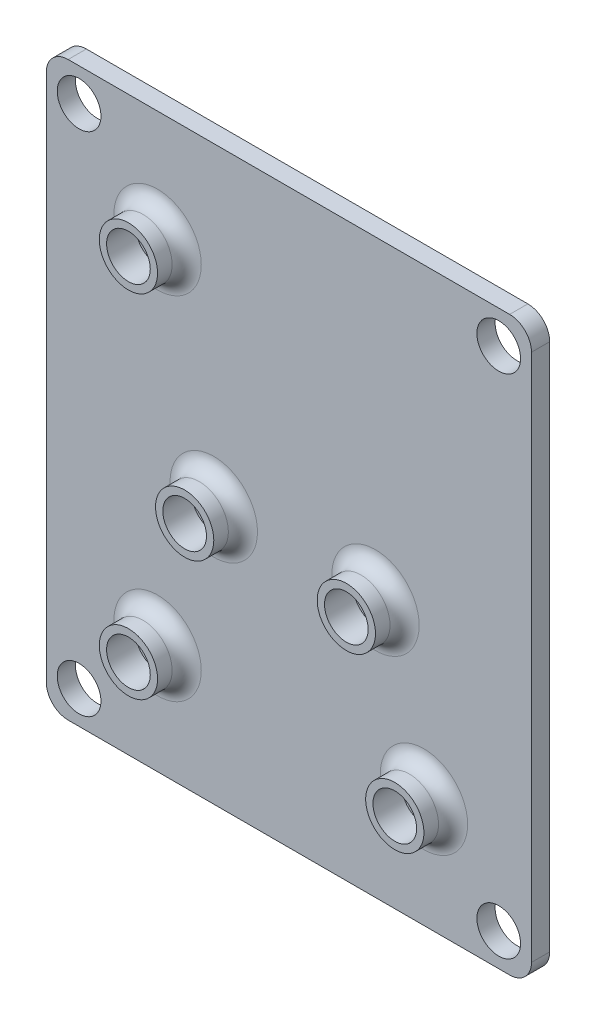
ISO-10303-21;
HEADER;
FILE_DESCRIPTION(('STEP AP214'),'2;1');
FILE_NAME('part.step','',(''),(''),'','','');
FILE_SCHEMA(('AUTOMOTIVE_DESIGN { 1 0 10303 214 1 1 1 1 }'));
ENDSEC;
DATA;
#1=APPLICATION_CONTEXT('core data for automotive mechanical design processes');
#2=APPLICATION_PROTOCOL_DEFINITION('international standard','automotive_design',2000,#1);
#3=PRODUCT_CONTEXT('',#1,'mechanical');
#4=PRODUCT('Part','Part','',(#3));
#5=PRODUCT_RELATED_PRODUCT_CATEGORY('part','',(#4));
#6=PRODUCT_DEFINITION_FORMATION('','',#4);
#7=PRODUCT_DEFINITION_CONTEXT('part definition',#1,'design');
#8=PRODUCT_DEFINITION('design','',#6,#7);
#9=PRODUCT_DEFINITION_SHAPE('','',#8);
#10=(LENGTH_UNIT() NAMED_UNIT(*) SI_UNIT(.MILLI.,.METRE.));
#11=(NAMED_UNIT(*) PLANE_ANGLE_UNIT() SI_UNIT($,.RADIAN.));
#12=(NAMED_UNIT(*) SI_UNIT($,.STERADIAN.) SOLID_ANGLE_UNIT());
#13=UNCERTAINTY_MEASURE_WITH_UNIT(LENGTH_MEASURE(1.E-05),#10,'distance_accuracy_value','');
#14=(GEOMETRIC_REPRESENTATION_CONTEXT(3) GLOBAL_UNCERTAINTY_ASSIGNED_CONTEXT((#13)) GLOBAL_UNIT_ASSIGNED_CONTEXT((#10,
#11,#12)) REPRESENTATION_CONTEXT('',''));
#15=CARTESIAN_POINT('',(0.,0.,0.));
#16=DIRECTION('',(0.,0.,1.));
#17=DIRECTION('',(1.,0.,0.));
#18=AXIS2_PLACEMENT_3D('',#15,#16,#17);
#19=CARTESIAN_POINT('',(0.,0.,0.));
#20=DIRECTION('',(0.,0.,1.));
#21=DIRECTION('',(1.,0.,0.));
#22=AXIS2_PLACEMENT_3D('',#19,#20,#21);
#23=PLANE('',#22);
#24=CARTESIAN_POINT('',(3.048,2.921,0.));
#25=DIRECTION('',(0.,0.,1.));
#26=DIRECTION('',(1.,0.,0.));
#27=AXIS2_PLACEMENT_3D('',#24,#25,#26);
#28=CIRCLE('',#27,3.);
#29=CARTESIAN_POINT('',(6.048,2.921,0.));
#30=VERTEX_POINT('',#29);
#31=EDGE_CURVE('E194',#30,#30,#28,.F.);
#32=ORIENTED_EDGE('',*,*,#31,.T.);
#33=EDGE_LOOP('',(#32));
#34=FACE_BOUND('',#33,.T.);
#35=CARTESIAN_POINT('',(21.336,2.921,0.));
#36=DIRECTION('',(0.,0.,1.));
#37=DIRECTION('',(1.,0.,0.));
#38=AXIS2_PLACEMENT_3D('',#35,#36,#37);
#39=CIRCLE('',#38,3.);
#40=CARTESIAN_POINT('',(24.336,2.921,0.));
#41=VERTEX_POINT('',#40);
#42=EDGE_CURVE('E191',#41,#41,#39,.F.);
#43=ORIENTED_EDGE('',*,*,#42,.T.);
#44=EDGE_LOOP('',(#43));
#45=FACE_BOUND('',#44,.T.);
#46=CARTESIAN_POINT('',(18.008092,13.09497,0.));
#47=DIRECTION('',(0.,0.,1.));
#48=DIRECTION('',(1.,0.,0.));
#49=AXIS2_PLACEMENT_3D('',#46,#47,#48);
#50=CIRCLE('',#49,3.);
#51=CARTESIAN_POINT('',(21.008092,13.09497,0.));
#52=VERTEX_POINT('',#51);
#53=EDGE_CURVE('E188',#52,#52,#50,.F.);
#54=ORIENTED_EDGE('',*,*,#53,.T.);
#55=EDGE_LOOP('',(#54));
#56=FACE_BOUND('',#55,.T.);
#57=CARTESIAN_POINT('',(6.908038,13.09497,0.));
#58=DIRECTION('',(0.,0.,1.));
#59=DIRECTION('',(1.,0.,0.));
#60=AXIS2_PLACEMENT_3D('',#57,#58,#59);
#61=CIRCLE('',#60,3.);
#62=CARTESIAN_POINT('',(9.908038,13.09497,0.));
#63=VERTEX_POINT('',#62);
#64=EDGE_CURVE('E185',#63,#63,#61,.F.);
#65=ORIENTED_EDGE('',*,*,#64,.T.);
#66=EDGE_LOOP('',(#65));
#67=FACE_BOUND('',#66,.T.);
#68=CARTESIAN_POINT('',(3.048,27.051,0.));
#69=DIRECTION('',(0.,0.,1.));
#70=DIRECTION('',(1.,0.,0.));
#71=AXIS2_PLACEMENT_3D('',#68,#69,#70);
#72=CIRCLE('',#71,3.);
#73=CARTESIAN_POINT('',(6.048,27.051,0.));
#74=VERTEX_POINT('',#73);
#75=EDGE_CURVE('E182',#74,#74,#72,.F.);
#76=ORIENTED_EDGE('',*,*,#75,.T.);
#77=EDGE_LOOP('',(#76));
#78=FACE_BOUND('',#77,.T.);
#79=CARTESIAN_POINT('',(-2.34099025766973,32.4399902576697,0.));
#80=DIRECTION('',(0.,0.,1.));
#81=DIRECTION('',(1.,0.,0.));
#82=AXIS2_PLACEMENT_3D('',#79,#80,#81);
#83=CIRCLE('',#82,1.5);
#84=CARTESIAN_POINT('',(-0.840990257669723,32.4399902576697,0.));
#85=VERTEX_POINT('',#84);
#86=EDGE_CURVE('E128',#85,#85,#83,.F.);
#87=ORIENTED_EDGE('',*,*,#86,.T.);
#88=EDGE_LOOP('',(#87));
#89=FACE_BOUND('',#88,.T.);
#90=DIRECTION('',(0.,1.,0.));
#91=VECTOR('',#90,1.);
#92=CARTESIAN_POINT('',(-4.59099025766973,0.,0.));
#93=LINE('',#92,#91);
#94=CARTESIAN_POINT('',(-4.59099025766973,-3.09099025766973,0.));
#95=VERTEX_POINT('',#94);
#96=CARTESIAN_POINT('',(-4.59099025766973,33.1899902576697,0.));
#97=VERTEX_POINT('',#96);
#98=EDGE_CURVE('E119',#95,#97,#93,.T.);
#99=ORIENTED_EDGE('',*,*,#98,.F.);
#100=CARTESIAN_POINT('',(-3.09099025766973,-3.09099025766973,0.));
#101=DIRECTION('',(0.,0.,1.));
#102=DIRECTION('',(1.,0.,0.));
#103=AXIS2_PLACEMENT_3D('',#100,#101,#102);
#104=CIRCLE('',#103,1.5);
#105=CARTESIAN_POINT('',(-3.09099025766973,-4.59099025766973,0.));
#106=VERTEX_POINT('',#105);
#107=EDGE_CURVE('E102',#95,#106,#104,.T.);
#108=ORIENTED_EDGE('',*,*,#107,.T.);
#109=DIRECTION('',(1.,0.,0.));
#110=VECTOR('',#109,1.);
#111=CARTESIAN_POINT('',(0.,-4.59099025766973,0.));
#112=LINE('',#111,#110);
#113=CARTESIAN_POINT('',(27.2209902576697,-4.59099025766973,0.));
#114=VERTEX_POINT('',#113);
#115=EDGE_CURVE('E363',#106,#114,#112,.T.);
#116=ORIENTED_EDGE('',*,*,#115,.T.);
#117=CARTESIAN_POINT('',(27.2209902576697,-3.09099025766973,0.));
#118=DIRECTION('',(0.,0.,1.));
#119=DIRECTION('',(1.,0.,0.));
#120=AXIS2_PLACEMENT_3D('',#117,#118,#119);
#121=CIRCLE('',#120,1.5);
#122=CARTESIAN_POINT('',(28.7209902576697,-3.09099025766973,0.));
#123=VERTEX_POINT('',#122);
#124=EDGE_CURVE('E123',#114,#123,#121,.T.);
#125=ORIENTED_EDGE('',*,*,#124,.T.);
#126=DIRECTION('',(0.,1.,0.));
#127=VECTOR('',#126,1.);
#128=CARTESIAN_POINT('',(28.7209902576697,0.,0.));
#129=LINE('',#128,#127);
#130=CARTESIAN_POINT('',(28.7209902576697,33.1899902576697,0.));
#131=VERTEX_POINT('',#130);
#132=EDGE_CURVE('E135',#123,#131,#129,.T.);
#133=ORIENTED_EDGE('',*,*,#132,.T.);
#134=CARTESIAN_POINT('',(27.2209902576697,33.1899902576697,0.));
#135=DIRECTION('',(0.,0.,1.));
#136=DIRECTION('',(1.,0.,0.));
#137=AXIS2_PLACEMENT_3D('',#134,#135,#136);
#138=CIRCLE('',#137,1.5);
#139=CARTESIAN_POINT('',(27.2209902576697,34.6899902576697,0.));
#140=VERTEX_POINT('',#139);
#141=EDGE_CURVE('E142',#131,#140,#138,.T.);
#142=ORIENTED_EDGE('',*,*,#141,.T.);
#143=DIRECTION('',(1.,0.,0.));
#144=VECTOR('',#143,1.);
#145=CARTESIAN_POINT('',(0.,34.6899902576697,0.));
#146=LINE('',#145,#144);
#147=CARTESIAN_POINT('',(-3.09099025766973,34.6899902576697,0.));
#148=VERTEX_POINT('',#147);
#149=EDGE_CURVE('E129',#148,#140,#146,.T.);
#150=ORIENTED_EDGE('',*,*,#149,.F.);
#151=CARTESIAN_POINT('',(-3.09099025766973,33.1899902576697,0.));
#152=DIRECTION('',(0.,0.,1.));
#153=DIRECTION('',(1.,0.,0.));
#154=AXIS2_PLACEMENT_3D('',#151,#152,#153);
#155=CIRCLE('',#154,1.5);
#156=EDGE_CURVE('E113',#148,#97,#155,.T.);
#157=ORIENTED_EDGE('',*,*,#156,.T.);
#158=EDGE_LOOP('',(#99,#108,#116,#125,#133,#142,#150,#157));
#159=FACE_BOUND('',#158,.T.);
#160=CARTESIAN_POINT('',(-2.34099025766973,-2.34099025766974,0.));
#161=DIRECTION('',(0.,0.,1.));
#162=DIRECTION('',(1.,0.,0.));
#163=AXIS2_PLACEMENT_3D('',#160,#161,#162);
#164=CIRCLE('',#163,1.5);
#165=CARTESIAN_POINT('',(-0.840990257669725,-2.34099025766974,0.));
#166=VERTEX_POINT('',#165);
#167=EDGE_CURVE('E360',#166,#166,#164,.T.);
#168=ORIENTED_EDGE('',*,*,#167,.F.);
#169=EDGE_LOOP('',(#168));
#170=FACE_BOUND('',#169,.T.);
#171=CARTESIAN_POINT('',(26.4709902576697,-2.34099025766974,0.));
#172=DIRECTION('',(0.,0.,1.));
#173=DIRECTION('',(1.,0.,0.));
#174=AXIS2_PLACEMENT_3D('',#171,#172,#173);
#175=CIRCLE('',#174,1.5);
#176=CARTESIAN_POINT('',(27.9709902576697,-2.34099025766974,0.));
#177=VERTEX_POINT('',#176);
#178=EDGE_CURVE('E356',#177,#177,#175,.F.);
#179=ORIENTED_EDGE('',*,*,#178,.T.);
#180=EDGE_LOOP('',(#179));
#181=FACE_BOUND('',#180,.T.);
#182=CARTESIAN_POINT('',(26.4709902576697,32.4399902576697,0.));
#183=DIRECTION('',(0.,0.,1.));
#184=DIRECTION('',(1.,0.,0.));
#185=AXIS2_PLACEMENT_3D('',#182,#183,#184);
#186=CIRCLE('',#185,1.5);
#187=CARTESIAN_POINT('',(27.9709902576697,32.4399902576697,0.));
#188=VERTEX_POINT('',#187);
#189=EDGE_CURVE('E353',#188,#188,#186,.T.);
#190=ORIENTED_EDGE('',*,*,#189,.F.);
#191=EDGE_LOOP('',(#190));
#192=FACE_BOUND('',#191,.T.);
#193=ADVANCED_FACE('F35',(#34,#45,#56,#67,#78,#89,#159,#170,#181,#192),#23,.T.);
#194=CARTESIAN_POINT('',(0.,-4.59099025766973,-1.25));
#195=DIRECTION('',(0.,-1.,0.));
#196=DIRECTION('',(0.,0.,-1.));
#197=AXIS2_PLACEMENT_3D('',#194,#195,#196);
#198=PLANE('',#197);
#199=ORIENTED_EDGE('',*,*,#115,.F.);
#200=DIRECTION('',(0.,0.,1.));
#201=VECTOR('',#200,1.);
#202=CARTESIAN_POINT('',(-3.09099025766973,-4.59099025766973,-1.25));
#203=LINE('',#202,#201);
#204=CARTESIAN_POINT('',(-3.09099025766973,-4.59099025766973,-1.25));
#205=VERTEX_POINT('',#204);
#206=EDGE_CURVE('E107',#106,#205,#203,.F.);
#207=ORIENTED_EDGE('',*,*,#206,.T.);
#208=DIRECTION('',(1.,0.,0.));
#209=VECTOR('',#208,1.);
#210=CARTESIAN_POINT('',(0.,-4.59099025766973,-1.25));
#211=LINE('',#210,#209);
#212=CARTESIAN_POINT('',(27.2209902576697,-4.59099025766973,-1.25));
#213=VERTEX_POINT('',#212);
#214=EDGE_CURVE('E345',#205,#213,#211,.T.);
#215=ORIENTED_EDGE('',*,*,#214,.T.);
#216=DIRECTION('',(0.,0.,1.));
#217=VECTOR('',#216,1.);
#218=CARTESIAN_POINT('',(27.2209902576697,-4.59099025766973,-1.25));
#219=LINE('',#218,#217);
#220=EDGE_CURVE('E112',#213,#114,#219,.T.);
#221=ORIENTED_EDGE('',*,*,#220,.T.);
#222=EDGE_LOOP('',(#199,#207,#215,#221));
#223=FACE_BOUND('',#222,.T.);
#224=ADVANCED_FACE('F222',(#223),#198,.T.);
#225=CARTESIAN_POINT('',(-4.59099025766973,0.,-1.25));
#226=DIRECTION('',(1.,0.,0.));
#227=DIRECTION('',(0.,1.,0.));
#228=AXIS2_PLACEMENT_3D('',#225,#226,#227);
#229=PLANE('',#228);
#230=DIRECTION('',(0.,1.,0.));
#231=VECTOR('',#230,1.);
#232=CARTESIAN_POINT('',(-4.59099025766973,0.,-1.25));
#233=LINE('',#232,#231);
#234=CARTESIAN_POINT('',(-4.59099025766973,-3.09099025766973,-1.25));
#235=VERTEX_POINT('',#234);
#236=CARTESIAN_POINT('',(-4.59099025766973,33.1899902576697,-1.25));
#237=VERTEX_POINT('',#236);
#238=EDGE_CURVE('E122',#235,#237,#233,.T.);
#239=ORIENTED_EDGE('',*,*,#238,.F.);
#240=DIRECTION('',(0.,0.,1.));
#241=VECTOR('',#240,1.);
#242=CARTESIAN_POINT('',(-4.59099025766973,-3.09099025766973,0.));
#243=LINE('',#242,#241);
#244=EDGE_CURVE('E106',#235,#95,#243,.T.);
#245=ORIENTED_EDGE('',*,*,#244,.T.);
#246=ORIENTED_EDGE('',*,*,#98,.T.);
#247=DIRECTION('',(0.,0.,1.));
#248=VECTOR('',#247,1.);
#249=CARTESIAN_POINT('',(-4.59099025766973,33.1899902576697,-1.25));
#250=LINE('',#249,#248);
#251=EDGE_CURVE('E124',#97,#237,#250,.F.);
#252=ORIENTED_EDGE('',*,*,#251,.T.);
#253=EDGE_LOOP('',(#239,#245,#246,#252));
#254=FACE_BOUND('',#253,.T.);
#255=ADVANCED_FACE('F118',(#254),#229,.F.);
#256=CARTESIAN_POINT('',(0.,34.6899902576697,-1.25));
#257=DIRECTION('',(0.,-1.,0.));
#258=DIRECTION('',(0.,0.,-1.));
#259=AXIS2_PLACEMENT_3D('',#256,#257,#258);
#260=PLANE('',#259);
#261=DIRECTION('',(1.,0.,0.));
#262=VECTOR('',#261,1.);
#263=CARTESIAN_POINT('',(0.,34.6899902576697,-1.25));
#264=LINE('',#263,#262);
#265=CARTESIAN_POINT('',(-3.09099025766973,34.6899902576697,-1.25));
#266=VERTEX_POINT('',#265);
#267=CARTESIAN_POINT('',(27.2209902576697,34.6899902576697,-1.25));
#268=VERTEX_POINT('',#267);
#269=EDGE_CURVE('E349',#266,#268,#264,.T.);
#270=ORIENTED_EDGE('',*,*,#269,.F.);
#271=DIRECTION('',(0.,0.,1.));
#272=VECTOR('',#271,1.);
#273=CARTESIAN_POINT('',(-3.09099025766973,34.6899902576697,-1.25));
#274=LINE('',#273,#272);
#275=EDGE_CURVE('E157',#266,#148,#274,.T.);
#276=ORIENTED_EDGE('',*,*,#275,.T.);
#277=ORIENTED_EDGE('',*,*,#149,.T.);
#278=DIRECTION('',(0.,0.,1.));
#279=VECTOR('',#278,1.);
#280=CARTESIAN_POINT('',(27.2209902576697,34.6899902576697,-1.25));
#281=LINE('',#280,#279);
#282=EDGE_CURVE('E155',#140,#268,#281,.F.);
#283=ORIENTED_EDGE('',*,*,#282,.T.);
#284=EDGE_LOOP('',(#270,#276,#277,#283));
#285=FACE_BOUND('',#284,.T.);
#286=ADVANCED_FACE('F382',(#285),#260,.F.);
#287=CARTESIAN_POINT('',(28.7209902576697,0.,-1.25));
#288=DIRECTION('',(1.,0.,0.));
#289=DIRECTION('',(0.,0.,-1.));
#290=AXIS2_PLACEMENT_3D('',#287,#288,#289);
#291=PLANE('',#290);
#292=DIRECTION('',(0.,1.,0.));
#293=VECTOR('',#292,1.);
#294=CARTESIAN_POINT('',(28.7209902576697,0.,-1.25));
#295=LINE('',#294,#293);
#296=CARTESIAN_POINT('',(28.7209902576697,-3.09099025766973,-1.25));
#297=VERTEX_POINT('',#296);
#298=CARTESIAN_POINT('',(28.7209902576697,33.1899902576697,-1.25));
#299=VERTEX_POINT('',#298);
#300=EDGE_CURVE('E370',#297,#299,#295,.T.);
#301=ORIENTED_EDGE('',*,*,#300,.T.);
#302=DIRECTION('',(0.,0.,1.));
#303=VECTOR('',#302,1.);
#304=CARTESIAN_POINT('',(28.7209902576697,33.1899902576697,0.));
#305=LINE('',#304,#303);
#306=EDGE_CURVE('E161',#299,#131,#305,.T.);
#307=ORIENTED_EDGE('',*,*,#306,.T.);
#308=ORIENTED_EDGE('',*,*,#132,.F.);
#309=DIRECTION('',(0.,0.,1.));
#310=VECTOR('',#309,1.);
#311=CARTESIAN_POINT('',(28.7209902576697,-3.09099025766973,-1.25));
#312=LINE('',#311,#310);
#313=EDGE_CURVE('E57',#123,#297,#312,.F.);
#314=ORIENTED_EDGE('',*,*,#313,.T.);
#315=EDGE_LOOP('',(#301,#307,#308,#314));
#316=FACE_BOUND('',#315,.T.);
#317=ADVANCED_FACE('F365',(#316),#291,.T.);
#318=CARTESIAN_POINT('',(-2.34099025766973,-2.34099025766974,-1.25));
#319=DIRECTION('',(0.,0.,1.));
#320=DIRECTION('',(1.,0.,0.));
#321=AXIS2_PLACEMENT_3D('',#318,#319,#320);
#322=CYLINDRICAL_SURFACE('',#321,1.5);
#323=CARTESIAN_POINT('',(-2.34099025766973,-2.34099025766974,-1.25));
#324=DIRECTION('',(0.,0.,1.));
#325=DIRECTION('',(1.,0.,0.));
#326=AXIS2_PLACEMENT_3D('',#323,#324,#325);
#327=CIRCLE('',#326,1.5);
#328=CARTESIAN_POINT('',(-0.840990257669725,-2.34099025766974,-1.25));
#329=VERTEX_POINT('',#328);
#330=EDGE_CURVE('E341',#329,#329,#327,.T.);
#331=ORIENTED_EDGE('',*,*,#330,.F.);
#332=EDGE_LOOP('',(#331));
#333=FACE_BOUND('',#332,.T.);
#334=ORIENTED_EDGE('',*,*,#167,.T.);
#335=EDGE_LOOP('',(#334));
#336=FACE_BOUND('',#335,.T.);
#337=ADVANCED_FACE('F436',(#333,#336),#322,.F.);
#338=CARTESIAN_POINT('',(26.4709902576697,-2.34099025766974,-1.25));
#339=DIRECTION('',(0.,0.,1.));
#340=DIRECTION('',(1.,0.,0.));
#341=AXIS2_PLACEMENT_3D('',#338,#339,#340);
#342=CYLINDRICAL_SURFACE('',#341,1.5);
#343=CARTESIAN_POINT('',(26.4709902576697,-2.34099025766974,-1.25));
#344=DIRECTION('',(0.,0.,1.));
#345=DIRECTION('',(1.,0.,0.));
#346=AXIS2_PLACEMENT_3D('',#343,#344,#345);
#347=CIRCLE('',#346,1.5);
#348=CARTESIAN_POINT('',(27.9709902576697,-2.34099025766974,-1.25));
#349=VERTEX_POINT('',#348);
#350=EDGE_CURVE('E338',#349,#349,#347,.F.);
#351=ORIENTED_EDGE('',*,*,#350,.T.);
#352=EDGE_LOOP('',(#351));
#353=FACE_BOUND('',#352,.T.);
#354=ORIENTED_EDGE('',*,*,#178,.F.);
#355=EDGE_LOOP('',(#354));
#356=FACE_BOUND('',#355,.T.);
#357=ADVANCED_FACE('F433',(#353,#356),#342,.F.);
#358=CARTESIAN_POINT('',(26.4709902576697,32.4399902576697,-1.25));
#359=DIRECTION('',(0.,0.,1.));
#360=DIRECTION('',(1.,0.,0.));
#361=AXIS2_PLACEMENT_3D('',#358,#359,#360);
#362=CYLINDRICAL_SURFACE('',#361,1.5);
#363=CARTESIAN_POINT('',(26.4709902576697,32.4399902576697,-1.25));
#364=DIRECTION('',(0.,0.,1.));
#365=DIRECTION('',(1.,0.,0.));
#366=AXIS2_PLACEMENT_3D('',#363,#364,#365);
#367=CIRCLE('',#366,1.5);
#368=CARTESIAN_POINT('',(27.9709902576697,32.4399902576697,-1.25));
#369=VERTEX_POINT('',#368);
#370=EDGE_CURVE('E132',#369,#369,#367,.T.);
#371=ORIENTED_EDGE('',*,*,#370,.F.);
#372=EDGE_LOOP('',(#371));
#373=FACE_BOUND('',#372,.T.);
#374=ORIENTED_EDGE('',*,*,#189,.T.);
#375=EDGE_LOOP('',(#374));
#376=FACE_BOUND('',#375,.T.);
#377=ADVANCED_FACE('F330',(#373,#376),#362,.F.);
#378=CARTESIAN_POINT('',(-2.34099025766973,32.4399902576697,-1.25));
#379=DIRECTION('',(0.,0.,1.));
#380=DIRECTION('',(1.,0.,0.));
#381=AXIS2_PLACEMENT_3D('',#378,#379,#380);
#382=CYLINDRICAL_SURFACE('',#381,1.5);
#383=CARTESIAN_POINT('',(-2.34099025766973,32.4399902576697,-1.25));
#384=DIRECTION('',(0.,0.,1.));
#385=DIRECTION('',(1.,0.,0.));
#386=AXIS2_PLACEMENT_3D('',#383,#384,#385);
#387=CIRCLE('',#386,1.5);
#388=CARTESIAN_POINT('',(-0.840990257669723,32.4399902576697,-1.25));
#389=VERTEX_POINT('',#388);
#390=EDGE_CURVE('E139',#389,#389,#387,.F.);
#391=ORIENTED_EDGE('',*,*,#390,.T.);
#392=EDGE_LOOP('',(#391));
#393=FACE_BOUND('',#392,.T.);
#394=ORIENTED_EDGE('',*,*,#86,.F.);
#395=EDGE_LOOP('',(#394));
#396=FACE_BOUND('',#395,.T.);
#397=ADVANCED_FACE('F322',(#393,#396),#382,.F.);
#398=CARTESIAN_POINT('',(0.,0.,-1.25));
#399=DIRECTION('',(0.,0.,1.));
#400=DIRECTION('',(1.,0.,0.));
#401=AXIS2_PLACEMENT_3D('',#398,#399,#400);
#402=PLANE('',#401);
#403=ORIENTED_EDGE('',*,*,#370,.T.);
#404=EDGE_LOOP('',(#403));
#405=FACE_BOUND('',#404,.T.);
#406=ORIENTED_EDGE('',*,*,#350,.F.);
#407=EDGE_LOOP('',(#406));
#408=FACE_BOUND('',#407,.T.);
#409=ORIENTED_EDGE('',*,*,#330,.T.);
#410=EDGE_LOOP('',(#409));
#411=FACE_BOUND('',#410,.T.);
#412=ORIENTED_EDGE('',*,*,#214,.F.);
#413=CARTESIAN_POINT('',(-3.09099025766973,-3.09099025766973,-1.25));
#414=DIRECTION('',(0.,0.,1.));
#415=DIRECTION('',(1.,0.,0.));
#416=AXIS2_PLACEMENT_3D('',#413,#414,#415);
#417=CIRCLE('',#416,1.5);
#418=EDGE_CURVE('E153',#205,#235,#417,.F.);
#419=ORIENTED_EDGE('',*,*,#418,.T.);
#420=ORIENTED_EDGE('',*,*,#238,.T.);
#421=CARTESIAN_POINT('',(-3.09099025766973,33.1899902576697,-1.25));
#422=DIRECTION('',(0.,0.,1.));
#423=DIRECTION('',(1.,0.,0.));
#424=AXIS2_PLACEMENT_3D('',#421,#422,#423);
#425=CIRCLE('',#424,1.5);
#426=EDGE_CURVE('E151',#237,#266,#425,.F.);
#427=ORIENTED_EDGE('',*,*,#426,.T.);
#428=ORIENTED_EDGE('',*,*,#269,.T.);
#429=CARTESIAN_POINT('',(27.2209902576697,33.1899902576697,-1.25));
#430=DIRECTION('',(0.,0.,1.));
#431=DIRECTION('',(1.,0.,0.));
#432=AXIS2_PLACEMENT_3D('',#429,#430,#431);
#433=CIRCLE('',#432,1.5);
#434=EDGE_CURVE('E50',#268,#299,#433,.F.);
#435=ORIENTED_EDGE('',*,*,#434,.T.);
#436=ORIENTED_EDGE('',*,*,#300,.F.);
#437=CARTESIAN_POINT('',(27.2209902576697,-3.09099025766973,-1.25));
#438=DIRECTION('',(0.,0.,1.));
#439=DIRECTION('',(1.,0.,0.));
#440=AXIS2_PLACEMENT_3D('',#437,#438,#439);
#441=CIRCLE('',#440,1.5);
#442=EDGE_CURVE('E148',#297,#213,#441,.F.);
#443=ORIENTED_EDGE('',*,*,#442,.T.);
#444=EDGE_LOOP('',(#412,#419,#420,#427,#428,#435,#436,#443));
#445=FACE_BOUND('',#444,.T.);
#446=ORIENTED_EDGE('',*,*,#390,.F.);
#447=EDGE_LOOP('',(#446));
#448=FACE_BOUND('',#447,.T.);
#449=ADVANCED_FACE('F320',(#405,#408,#411,#445,#448),#402,.F.);
#450=CARTESIAN_POINT('',(-3.09099025766973,-3.09099025766973,-1.25));
#451=DIRECTION('',(0.,0.,-1.));
#452=DIRECTION('',(-1.,0.,0.));
#453=AXIS2_PLACEMENT_3D('',#450,#451,#452);
#454=CYLINDRICAL_SURFACE('',#453,1.5);
#455=ORIENTED_EDGE('',*,*,#418,.F.);
#456=ORIENTED_EDGE('',*,*,#206,.F.);
#457=ORIENTED_EDGE('',*,*,#107,.F.);
#458=ORIENTED_EDGE('',*,*,#244,.F.);
#459=EDGE_LOOP('',(#455,#456,#457,#458));
#460=FACE_BOUND('',#459,.T.);
#461=ADVANCED_FACE('F105',(#460),#454,.T.);
#462=CARTESIAN_POINT('',(-3.09099025766973,33.1899902576697,-1.25));
#463=DIRECTION('',(0.,0.,1.));
#464=DIRECTION('',(1.,0.,0.));
#465=AXIS2_PLACEMENT_3D('',#462,#463,#464);
#466=CYLINDRICAL_SURFACE('',#465,1.5);
#467=ORIENTED_EDGE('',*,*,#426,.F.);
#468=ORIENTED_EDGE('',*,*,#251,.F.);
#469=ORIENTED_EDGE('',*,*,#156,.F.);
#470=ORIENTED_EDGE('',*,*,#275,.F.);
#471=EDGE_LOOP('',(#467,#468,#469,#470));
#472=FACE_BOUND('',#471,.T.);
#473=ADVANCED_FACE('F328',(#472),#466,.T.);
#474=CARTESIAN_POINT('',(27.2209902576697,33.1899902576697,-1.25));
#475=DIRECTION('',(0.,0.,-1.));
#476=DIRECTION('',(-1.,0.,0.));
#477=AXIS2_PLACEMENT_3D('',#474,#475,#476);
#478=CYLINDRICAL_SURFACE('',#477,1.5);
#479=ORIENTED_EDGE('',*,*,#434,.F.);
#480=ORIENTED_EDGE('',*,*,#282,.F.);
#481=ORIENTED_EDGE('',*,*,#141,.F.);
#482=ORIENTED_EDGE('',*,*,#306,.F.);
#483=EDGE_LOOP('',(#479,#480,#481,#482));
#484=FACE_BOUND('',#483,.T.);
#485=ADVANCED_FACE('F381',(#484),#478,.T.);
#486=CARTESIAN_POINT('',(27.2209902576697,-3.09099025766973,-1.25));
#487=DIRECTION('',(0.,0.,1.));
#488=DIRECTION('',(1.,0.,0.));
#489=AXIS2_PLACEMENT_3D('',#486,#487,#488);
#490=CYLINDRICAL_SURFACE('',#489,1.5);
#491=ORIENTED_EDGE('',*,*,#442,.F.);
#492=ORIENTED_EDGE('',*,*,#313,.F.);
#493=ORIENTED_EDGE('',*,*,#124,.F.);
#494=ORIENTED_EDGE('',*,*,#220,.F.);
#495=EDGE_LOOP('',(#491,#492,#493,#494));
#496=FACE_BOUND('',#495,.T.);
#497=ADVANCED_FACE('F318',(#496),#490,.T.);
#498=CARTESIAN_POINT('',(3.048,27.051,2.));
#499=DIRECTION('',(0.,0.,-1.));
#500=DIRECTION('',(-1.,0.,0.));
#501=AXIS2_PLACEMENT_3D('',#498,#499,#500);
#502=CYLINDRICAL_SURFACE('',#501,1.5);
#503=CARTESIAN_POINT('',(3.048,27.051,2.));
#504=DIRECTION('',(0.,0.,1.));
#505=DIRECTION('',(1.,0.,0.));
#506=AXIS2_PLACEMENT_3D('',#503,#504,#505);
#507=CIRCLE('',#506,1.5);
#508=CARTESIAN_POINT('',(4.548,27.051,2.));
#509=VERTEX_POINT('',#508);
#510=EDGE_CURVE('E427',#509,#509,#507,.T.);
#511=ORIENTED_EDGE('',*,*,#510,.T.);
#512=EDGE_LOOP('',(#511));
#513=FACE_BOUND('',#512,.T.);
#514=CARTESIAN_POINT('',(3.048,27.051,0.));
#515=DIRECTION('',(0.,0.,1.));
#516=DIRECTION('',(1.,0.,0.));
#517=AXIS2_PLACEMENT_3D('',#514,#515,#516);
#518=CIRCLE('',#517,1.5);
#519=CARTESIAN_POINT('',(4.548,27.051,0.));
#520=VERTEX_POINT('',#519);
#521=EDGE_CURVE('E164',#520,#520,#518,.F.);
#522=ORIENTED_EDGE('',*,*,#521,.T.);
#523=EDGE_LOOP('',(#522));
#524=FACE_BOUND('',#523,.T.);
#525=ADVANCED_FACE('F315',(#513,#524),#502,.F.);
#526=CARTESIAN_POINT('',(3.048,27.051,2.));
#527=DIRECTION('',(0.,0.,-1.));
#528=DIRECTION('',(-1.,0.,0.));
#529=AXIS2_PLACEMENT_3D('',#526,#527,#528);
#530=CYLINDRICAL_SURFACE('',#529,2.);
#531=CARTESIAN_POINT('',(3.048,27.051,1.));
#532=DIRECTION('',(0.,0.,1.));
#533=DIRECTION('',(1.,0.,0.));
#534=AXIS2_PLACEMENT_3D('',#531,#532,#533);
#535=CIRCLE('',#534,2.);
#536=CARTESIAN_POINT('',(5.048,27.051,1.));
#537=VERTEX_POINT('',#536);
#538=EDGE_CURVE('E11',#537,#537,#535,.T.);
#539=ORIENTED_EDGE('',*,*,#538,.T.);
#540=EDGE_LOOP('',(#539));
#541=FACE_BOUND('',#540,.T.);
#542=CARTESIAN_POINT('',(3.048,27.051,2.));
#543=DIRECTION('',(0.,0.,1.));
#544=DIRECTION('',(1.,0.,0.));
#545=AXIS2_PLACEMENT_3D('',#542,#543,#544);
#546=CIRCLE('',#545,2.);
#547=CARTESIAN_POINT('',(5.048,27.051,2.));
#548=VERTEX_POINT('',#547);
#549=EDGE_CURVE('E357',#548,#548,#546,.T.);
#550=ORIENTED_EDGE('',*,*,#549,.F.);
#551=EDGE_LOOP('',(#550));
#552=FACE_BOUND('',#551,.T.);
#553=ADVANCED_FACE('F251',(#541,#552),#530,.T.);
#554=CARTESIAN_POINT('',(0.,0.,2.));
#555=DIRECTION('',(0.,0.,1.));
#556=DIRECTION('',(1.,0.,0.));
#557=AXIS2_PLACEMENT_3D('',#554,#555,#556);
#558=PLANE('',#557);
#559=ORIENTED_EDGE('',*,*,#510,.F.);
#560=EDGE_LOOP('',(#559));
#561=FACE_BOUND('',#560,.T.);
#562=ORIENTED_EDGE('',*,*,#549,.T.);
#563=EDGE_LOOP('',(#562));
#564=FACE_BOUND('',#563,.T.);
#565=ADVANCED_FACE('F242',(#561,#564),#558,.T.);
#566=ORIENTED_EDGE('',*,*,#521,.F.);
#567=EDGE_LOOP('',(#566));
#568=FACE_BOUND('',#567,.T.);
#569=ADVANCED_FACE('F226',(#568),#23,.T.);
#570=CARTESIAN_POINT('',(6.908038,13.09497,2.));
#571=DIRECTION('',(0.,0.,-1.));
#572=DIRECTION('',(-1.,0.,0.));
#573=AXIS2_PLACEMENT_3D('',#570,#571,#572);
#574=CYLINDRICAL_SURFACE('',#573,1.5);
#575=CARTESIAN_POINT('',(6.908038,13.09497,2.));
#576=DIRECTION('',(0.,0.,1.));
#577=DIRECTION('',(1.,0.,0.));
#578=AXIS2_PLACEMENT_3D('',#575,#576,#577);
#579=CIRCLE('',#578,1.5);
#580=CARTESIAN_POINT('',(8.408038,13.09497,2.));
#581=VERTEX_POINT('',#580);
#582=EDGE_CURVE('E421',#581,#581,#579,.T.);
#583=ORIENTED_EDGE('',*,*,#582,.T.);
#584=EDGE_LOOP('',(#583));
#585=FACE_BOUND('',#584,.T.);
#586=CARTESIAN_POINT('',(6.908038,13.09497,0.));
#587=DIRECTION('',(0.,0.,1.));
#588=DIRECTION('',(1.,0.,0.));
#589=AXIS2_PLACEMENT_3D('',#586,#587,#588);
#590=CIRCLE('',#589,1.5);
#591=CARTESIAN_POINT('',(8.408038,13.09497,0.));
#592=VERTEX_POINT('',#591);
#593=EDGE_CURVE('E167',#592,#592,#590,.F.);
#594=ORIENTED_EDGE('',*,*,#593,.T.);
#595=EDGE_LOOP('',(#594));
#596=FACE_BOUND('',#595,.T.);
#597=ADVANCED_FACE('F241',(#585,#596),#574,.F.);
#598=CARTESIAN_POINT('',(6.908038,13.09497,2.));
#599=DIRECTION('',(0.,0.,-1.));
#600=DIRECTION('',(-1.,0.,0.));
#601=AXIS2_PLACEMENT_3D('',#598,#599,#600);
#602=CYLINDRICAL_SURFACE('',#601,2.);
#603=CARTESIAN_POINT('',(6.908038,13.09497,1.));
#604=DIRECTION('',(0.,0.,1.));
#605=DIRECTION('',(1.,0.,0.));
#606=AXIS2_PLACEMENT_3D('',#603,#604,#605);
#607=CIRCLE('',#606,2.);
#608=CARTESIAN_POINT('',(8.908038,13.09497,1.));
#609=VERTEX_POINT('',#608);
#610=EDGE_CURVE('E43',#609,#609,#607,.T.);
#611=ORIENTED_EDGE('',*,*,#610,.T.);
#612=EDGE_LOOP('',(#611));
#613=FACE_BOUND('',#612,.T.);
#614=CARTESIAN_POINT('',(6.908038,13.09497,2.));
#615=DIRECTION('',(0.,0.,1.));
#616=DIRECTION('',(1.,0.,0.));
#617=AXIS2_PLACEMENT_3D('',#614,#615,#616);
#618=CIRCLE('',#617,2.);
#619=CARTESIAN_POINT('',(8.908038,13.09497,2.));
#620=VERTEX_POINT('',#619);
#621=EDGE_CURVE('E424',#620,#620,#618,.T.);
#622=ORIENTED_EDGE('',*,*,#621,.F.);
#623=EDGE_LOOP('',(#622));
#624=FACE_BOUND('',#623,.T.);
#625=ADVANCED_FACE('F205',(#613,#624),#602,.T.);
#626=CARTESIAN_POINT('',(0.,0.,2.));
#627=DIRECTION('',(0.,0.,1.));
#628=DIRECTION('',(1.,0.,0.));
#629=AXIS2_PLACEMENT_3D('',#626,#627,#628);
#630=PLANE('',#629);
#631=ORIENTED_EDGE('',*,*,#582,.F.);
#632=EDGE_LOOP('',(#631));
#633=FACE_BOUND('',#632,.T.);
#634=ORIENTED_EDGE('',*,*,#621,.T.);
#635=EDGE_LOOP('',(#634));
#636=FACE_BOUND('',#635,.T.);
#637=ADVANCED_FACE('F257',(#633,#636),#630,.T.);
#638=ORIENTED_EDGE('',*,*,#593,.F.);
#639=EDGE_LOOP('',(#638));
#640=FACE_BOUND('',#639,.T.);
#641=ADVANCED_FACE('F244',(#640),#23,.T.);
#642=CARTESIAN_POINT('',(18.008092,13.09497,2.));
#643=DIRECTION('',(0.,0.,-1.));
#644=DIRECTION('',(-1.,0.,0.));
#645=AXIS2_PLACEMENT_3D('',#642,#643,#644);
#646=CYLINDRICAL_SURFACE('',#645,1.5);
#647=CARTESIAN_POINT('',(18.008092,13.09497,2.));
#648=DIRECTION('',(0.,0.,1.));
#649=DIRECTION('',(1.,0.,0.));
#650=AXIS2_PLACEMENT_3D('',#647,#648,#649);
#651=CIRCLE('',#650,1.5);
#652=CARTESIAN_POINT('',(19.508092,13.09497,2.));
#653=VERTEX_POINT('',#652);
#654=EDGE_CURVE('E408',#653,#653,#651,.T.);
#655=ORIENTED_EDGE('',*,*,#654,.T.);
#656=EDGE_LOOP('',(#655));
#657=FACE_BOUND('',#656,.T.);
#658=CARTESIAN_POINT('',(18.008092,13.09497,0.));
#659=DIRECTION('',(0.,0.,1.));
#660=DIRECTION('',(1.,0.,0.));
#661=AXIS2_PLACEMENT_3D('',#658,#659,#660);
#662=CIRCLE('',#661,1.5);
#663=CARTESIAN_POINT('',(19.508092,13.09497,0.));
#664=VERTEX_POINT('',#663);
#665=EDGE_CURVE('E170',#664,#664,#662,.F.);
#666=ORIENTED_EDGE('',*,*,#665,.T.);
#667=EDGE_LOOP('',(#666));
#668=FACE_BOUND('',#667,.T.);
#669=ADVANCED_FACE('F256',(#657,#668),#646,.F.);
#670=CARTESIAN_POINT('',(18.008092,13.09497,2.));
#671=DIRECTION('',(0.,0.,-1.));
#672=DIRECTION('',(-1.,0.,0.));
#673=AXIS2_PLACEMENT_3D('',#670,#671,#672);
#674=CYLINDRICAL_SURFACE('',#673,2.);
#675=CARTESIAN_POINT('',(18.008092,13.09497,1.));
#676=DIRECTION('',(0.,0.,1.));
#677=DIRECTION('',(1.,0.,0.));
#678=AXIS2_PLACEMENT_3D('',#675,#676,#677);
#679=CIRCLE('',#678,2.);
#680=CARTESIAN_POINT('',(20.008092,13.09497,1.));
#681=VERTEX_POINT('',#680);
#682=EDGE_CURVE('E200',#681,#681,#679,.T.);
#683=ORIENTED_EDGE('',*,*,#682,.T.);
#684=EDGE_LOOP('',(#683));
#685=FACE_BOUND('',#684,.T.);
#686=CARTESIAN_POINT('',(18.008092,13.09497,2.));
#687=DIRECTION('',(0.,0.,1.));
#688=DIRECTION('',(1.,0.,0.));
#689=AXIS2_PLACEMENT_3D('',#686,#687,#688);
#690=CIRCLE('',#689,2.);
#691=CARTESIAN_POINT('',(20.008092,13.09497,2.));
#692=VERTEX_POINT('',#691);
#693=EDGE_CURVE('E412',#692,#692,#690,.T.);
#694=ORIENTED_EDGE('',*,*,#693,.F.);
#695=EDGE_LOOP('',(#694));
#696=FACE_BOUND('',#695,.T.);
#697=ADVANCED_FACE('F264',(#685,#696),#674,.T.);
#698=CARTESIAN_POINT('',(0.,0.,2.));
#699=DIRECTION('',(0.,0.,1.));
#700=DIRECTION('',(1.,0.,0.));
#701=AXIS2_PLACEMENT_3D('',#698,#699,#700);
#702=PLANE('',#701);
#703=ORIENTED_EDGE('',*,*,#654,.F.);
#704=EDGE_LOOP('',(#703));
#705=FACE_BOUND('',#704,.T.);
#706=ORIENTED_EDGE('',*,*,#693,.T.);
#707=EDGE_LOOP('',(#706));
#708=FACE_BOUND('',#707,.T.);
#709=ADVANCED_FACE('F272',(#705,#708),#702,.T.);
#710=ORIENTED_EDGE('',*,*,#665,.F.);
#711=EDGE_LOOP('',(#710));
#712=FACE_BOUND('',#711,.T.);
#713=ADVANCED_FACE('F259',(#712),#23,.T.);
#714=CARTESIAN_POINT('',(21.336,2.921,2.));
#715=DIRECTION('',(0.,0.,-1.));
#716=DIRECTION('',(-1.,0.,0.));
#717=AXIS2_PLACEMENT_3D('',#714,#715,#716);
#718=CYLINDRICAL_SURFACE('',#717,1.5);
#719=CARTESIAN_POINT('',(21.336,2.921,2.));
#720=DIRECTION('',(0.,0.,1.));
#721=DIRECTION('',(1.,0.,0.));
#722=AXIS2_PLACEMENT_3D('',#719,#720,#721);
#723=CIRCLE('',#722,1.5);
#724=CARTESIAN_POINT('',(22.836,2.921,2.));
#725=VERTEX_POINT('',#724);
#726=EDGE_CURVE('E409',#725,#725,#723,.T.);
#727=ORIENTED_EDGE('',*,*,#726,.T.);
#728=EDGE_LOOP('',(#727));
#729=FACE_BOUND('',#728,.T.);
#730=CARTESIAN_POINT('',(21.336,2.921,0.));
#731=DIRECTION('',(0.,0.,1.));
#732=DIRECTION('',(1.,0.,0.));
#733=AXIS2_PLACEMENT_3D('',#730,#731,#732);
#734=CIRCLE('',#733,1.5);
#735=CARTESIAN_POINT('',(22.836,2.921,0.));
#736=VERTEX_POINT('',#735);
#737=EDGE_CURVE('E173',#736,#736,#734,.F.);
#738=ORIENTED_EDGE('',*,*,#737,.T.);
#739=EDGE_LOOP('',(#738));
#740=FACE_BOUND('',#739,.T.);
#741=ADVANCED_FACE('F271',(#729,#740),#718,.F.);
#742=CARTESIAN_POINT('',(21.336,2.921,2.));
#743=DIRECTION('',(0.,0.,-1.));
#744=DIRECTION('',(-1.,0.,0.));
#745=AXIS2_PLACEMENT_3D('',#742,#743,#744);
#746=CYLINDRICAL_SURFACE('',#745,2.);
#747=CARTESIAN_POINT('',(21.336,2.921,1.));
#748=DIRECTION('',(0.,0.,1.));
#749=DIRECTION('',(1.,0.,0.));
#750=AXIS2_PLACEMENT_3D('',#747,#748,#749);
#751=CIRCLE('',#750,2.);
#752=CARTESIAN_POINT('',(23.336,2.921,1.));
#753=VERTEX_POINT('',#752);
#754=EDGE_CURVE('E197',#753,#753,#751,.T.);
#755=ORIENTED_EDGE('',*,*,#754,.T.);
#756=EDGE_LOOP('',(#755));
#757=FACE_BOUND('',#756,.T.);
#758=CARTESIAN_POINT('',(21.336,2.921,2.));
#759=DIRECTION('',(0.,0.,1.));
#760=DIRECTION('',(1.,0.,0.));
#761=AXIS2_PLACEMENT_3D('',#758,#759,#760);
#762=CIRCLE('',#761,2.);
#763=CARTESIAN_POINT('',(23.336,2.921,2.));
#764=VERTEX_POINT('',#763);
#765=EDGE_CURVE('E407',#764,#764,#762,.T.);
#766=ORIENTED_EDGE('',*,*,#765,.F.);
#767=EDGE_LOOP('',(#766));
#768=FACE_BOUND('',#767,.T.);
#769=ADVANCED_FACE('F278',(#757,#768),#746,.T.);
#770=CARTESIAN_POINT('',(0.,0.,2.));
#771=DIRECTION('',(0.,0.,1.));
#772=DIRECTION('',(1.,0.,0.));
#773=AXIS2_PLACEMENT_3D('',#770,#771,#772);
#774=PLANE('',#773);
#775=ORIENTED_EDGE('',*,*,#726,.F.);
#776=EDGE_LOOP('',(#775));
#777=FACE_BOUND('',#776,.T.);
#778=ORIENTED_EDGE('',*,*,#765,.T.);
#779=EDGE_LOOP('',(#778));
#780=FACE_BOUND('',#779,.T.);
#781=ADVANCED_FACE('F286',(#777,#780),#774,.T.);
#782=ORIENTED_EDGE('',*,*,#737,.F.);
#783=EDGE_LOOP('',(#782));
#784=FACE_BOUND('',#783,.T.);
#785=ADVANCED_FACE('F239',(#784),#23,.T.);
#786=CARTESIAN_POINT('',(3.048,2.921,2.));
#787=DIRECTION('',(0.,0.,-1.));
#788=DIRECTION('',(-1.,0.,0.));
#789=AXIS2_PLACEMENT_3D('',#786,#787,#788);
#790=CYLINDRICAL_SURFACE('',#789,1.5);
#791=CARTESIAN_POINT('',(3.048,2.921,2.));
#792=DIRECTION('',(0.,0.,1.));
#793=DIRECTION('',(1.,0.,0.));
#794=AXIS2_PLACEMENT_3D('',#791,#792,#793);
#795=CIRCLE('',#794,1.5);
#796=CARTESIAN_POINT('',(4.548,2.921,2.));
#797=VERTEX_POINT('',#796);
#798=EDGE_CURVE('E662',#797,#797,#795,.T.);
#799=ORIENTED_EDGE('',*,*,#798,.T.);
#800=EDGE_LOOP('',(#799));
#801=FACE_BOUND('',#800,.T.);
#802=CARTESIAN_POINT('',(3.048,2.921,0.));
#803=DIRECTION('',(0.,0.,1.));
#804=DIRECTION('',(1.,0.,0.));
#805=AXIS2_PLACEMENT_3D('',#802,#803,#804);
#806=CIRCLE('',#805,1.5);
#807=CARTESIAN_POINT('',(4.548,2.921,0.));
#808=VERTEX_POINT('',#807);
#809=EDGE_CURVE('E176',#808,#808,#806,.F.);
#810=ORIENTED_EDGE('',*,*,#809,.T.);
#811=EDGE_LOOP('',(#810));
#812=FACE_BOUND('',#811,.T.);
#813=ADVANCED_FACE('F285',(#801,#812),#790,.F.);
#814=CARTESIAN_POINT('',(3.048,2.921,2.));
#815=DIRECTION('',(0.,0.,-1.));
#816=DIRECTION('',(-1.,0.,0.));
#817=AXIS2_PLACEMENT_3D('',#814,#815,#816);
#818=CYLINDRICAL_SURFACE('',#817,2.);
#819=CARTESIAN_POINT('',(3.048,2.921,1.));
#820=DIRECTION('',(0.,0.,1.));
#821=DIRECTION('',(1.,0.,0.));
#822=AXIS2_PLACEMENT_3D('',#819,#820,#821);
#823=CIRCLE('',#822,2.);
#824=CARTESIAN_POINT('',(5.048,2.921,1.));
#825=VERTEX_POINT('',#824);
#826=EDGE_CURVE('E179',#825,#825,#823,.T.);
#827=ORIENTED_EDGE('',*,*,#826,.T.);
#828=EDGE_LOOP('',(#827));
#829=FACE_BOUND('',#828,.T.);
#830=CARTESIAN_POINT('',(3.048,2.921,2.));
#831=DIRECTION('',(0.,0.,1.));
#832=DIRECTION('',(1.,0.,0.));
#833=AXIS2_PLACEMENT_3D('',#830,#831,#832);
#834=CIRCLE('',#833,2.);
#835=CARTESIAN_POINT('',(5.048,2.921,2.));
#836=VERTEX_POINT('',#835);
#837=EDGE_CURVE('E415',#836,#836,#834,.T.);
#838=ORIENTED_EDGE('',*,*,#837,.F.);
#839=EDGE_LOOP('',(#838));
#840=FACE_BOUND('',#839,.T.);
#841=ADVANCED_FACE('F292',(#829,#840),#818,.T.);
#842=CARTESIAN_POINT('',(0.,0.,2.));
#843=DIRECTION('',(0.,0.,1.));
#844=DIRECTION('',(1.,0.,0.));
#845=AXIS2_PLACEMENT_3D('',#842,#843,#844);
#846=PLANE('',#845);
#847=ORIENTED_EDGE('',*,*,#798,.F.);
#848=EDGE_LOOP('',(#847));
#849=FACE_BOUND('',#848,.T.);
#850=ORIENTED_EDGE('',*,*,#837,.T.);
#851=EDGE_LOOP('',(#850));
#852=FACE_BOUND('',#851,.T.);
#853=ADVANCED_FACE('F237',(#849,#852),#846,.T.);
#854=ORIENTED_EDGE('',*,*,#809,.F.);
#855=EDGE_LOOP('',(#854));
#856=FACE_BOUND('',#855,.T.);
#857=ADVANCED_FACE('F225',(#856),#23,.T.);
#858=CARTESIAN_POINT('',(3.048,2.921,1.));
#859=DIRECTION('',(0.,0.,1.));
#860=DIRECTION('',(1.,0.,0.));
#861=AXIS2_PLACEMENT_3D('',#858,#859,#860);
#862=TOROIDAL_SURFACE('',#861,3.,1.);
#863=ORIENTED_EDGE('',*,*,#31,.F.);
#864=EDGE_LOOP('',(#863));
#865=FACE_BOUND('',#864,.T.);
#866=ORIENTED_EDGE('',*,*,#826,.F.);
#867=EDGE_LOOP('',(#866));
#868=FACE_BOUND('',#867,.T.);
#869=ADVANCED_FACE('F236',(#865,#868),#862,.F.);
#870=CARTESIAN_POINT('',(21.336,2.921,1.));
#871=DIRECTION('',(0.,0.,1.));
#872=DIRECTION('',(1.,0.,0.));
#873=AXIS2_PLACEMENT_3D('',#870,#871,#872);
#874=TOROIDAL_SURFACE('',#873,3.,1.);
#875=ORIENTED_EDGE('',*,*,#42,.F.);
#876=EDGE_LOOP('',(#875));
#877=FACE_BOUND('',#876,.T.);
#878=ORIENTED_EDGE('',*,*,#754,.F.);
#879=EDGE_LOOP('',(#878));
#880=FACE_BOUND('',#879,.T.);
#881=ADVANCED_FACE('F217',(#877,#880),#874,.F.);
#882=CARTESIAN_POINT('',(18.008092,13.09497,1.));
#883=DIRECTION('',(0.,0.,1.));
#884=DIRECTION('',(1.,0.,0.));
#885=AXIS2_PLACEMENT_3D('',#882,#883,#884);
#886=TOROIDAL_SURFACE('',#885,3.,1.);
#887=ORIENTED_EDGE('',*,*,#53,.F.);
#888=EDGE_LOOP('',(#887));
#889=FACE_BOUND('',#888,.T.);
#890=ORIENTED_EDGE('',*,*,#682,.F.);
#891=EDGE_LOOP('',(#890));
#892=FACE_BOUND('',#891,.T.);
#893=ADVANCED_FACE('F210',(#889,#892),#886,.F.);
#894=CARTESIAN_POINT('',(6.908038,13.09497,1.));
#895=DIRECTION('',(0.,0.,1.));
#896=DIRECTION('',(1.,0.,0.));
#897=AXIS2_PLACEMENT_3D('',#894,#895,#896);
#898=TOROIDAL_SURFACE('',#897,3.,1.);
#899=ORIENTED_EDGE('',*,*,#64,.F.);
#900=EDGE_LOOP('',(#899));
#901=FACE_BOUND('',#900,.T.);
#902=ORIENTED_EDGE('',*,*,#610,.F.);
#903=EDGE_LOOP('',(#902));
#904=FACE_BOUND('',#903,.T.);
#905=ADVANCED_FACE('F208',(#901,#904),#898,.F.);
#906=CARTESIAN_POINT('',(3.048,27.051,1.));
#907=DIRECTION('',(0.,0.,1.));
#908=DIRECTION('',(1.,0.,0.));
#909=AXIS2_PLACEMENT_3D('',#906,#907,#908);
#910=TOROIDAL_SURFACE('',#909,3.,1.);
#911=ORIENTED_EDGE('',*,*,#75,.F.);
#912=EDGE_LOOP('',(#911));
#913=FACE_BOUND('',#912,.T.);
#914=ORIENTED_EDGE('',*,*,#538,.F.);
#915=EDGE_LOOP('',(#914));
#916=FACE_BOUND('',#915,.T.);
#917=ADVANCED_FACE('F37',(#913,#916),#910,.F.);
#918=CLOSED_SHELL('',(#193,#224,#255,#286,#317,#337,#357,#377,#397,#449,#461,#473,#485,#497,
#525,#553,#565,#569,#597,#625,#637,#641,#669,#697,#709,#713,#741,#769,#781,#785,#813,#841,#853,
#857,#869,#881,#893,#905,#917));
#919=MANIFOLD_SOLID_BREP('B2',#918);
#920=ADVANCED_BREP_SHAPE_REPRESENTATION('',(#18,#919),#14);
#921=SHAPE_DEFINITION_REPRESENTATION(#9,#920);
ENDSEC;
END-ISO-10303-21;
